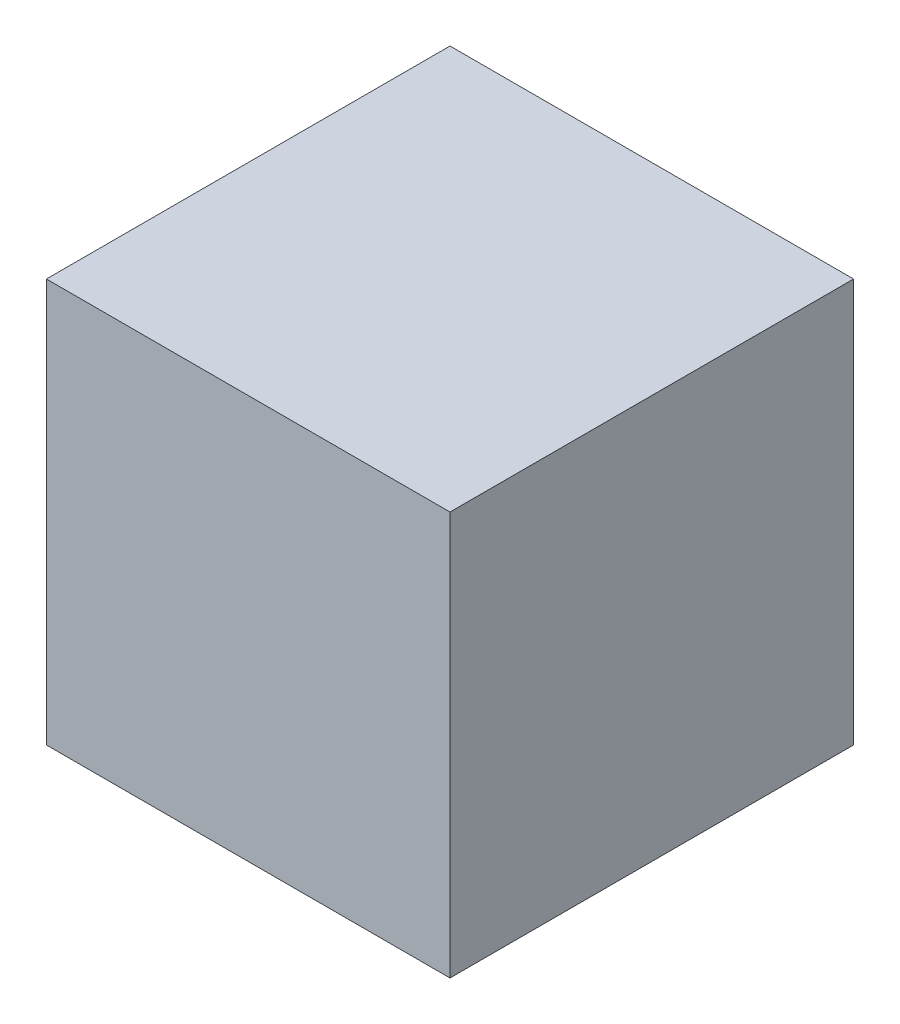
ISO-10303-21;
HEADER;
FILE_DESCRIPTION(('STEP AP214'),'2;1');
FILE_NAME('part.step','',(''),(''),'','','');
FILE_SCHEMA(('AUTOMOTIVE_DESIGN { 1 0 10303 214 1 1 1 1 }'));
ENDSEC;
DATA;
#1=APPLICATION_CONTEXT('core data for automotive mechanical design processes');
#2=APPLICATION_PROTOCOL_DEFINITION('international standard','automotive_design',2000,#1);
#3=PRODUCT_CONTEXT('',#1,'mechanical');
#4=PRODUCT('Part','Part','',(#3));
#5=PRODUCT_RELATED_PRODUCT_CATEGORY('part','',(#4));
#6=PRODUCT_DEFINITION_FORMATION('','',#4);
#7=PRODUCT_DEFINITION_CONTEXT('part definition',#1,'design');
#8=PRODUCT_DEFINITION('design','',#6,#7);
#9=PRODUCT_DEFINITION_SHAPE('','',#8);
#10=(LENGTH_UNIT() NAMED_UNIT(*) SI_UNIT(.MILLI.,.METRE.));
#11=(NAMED_UNIT(*) PLANE_ANGLE_UNIT() SI_UNIT($,.RADIAN.));
#12=(NAMED_UNIT(*) SI_UNIT($,.STERADIAN.) SOLID_ANGLE_UNIT());
#13=UNCERTAINTY_MEASURE_WITH_UNIT(LENGTH_MEASURE(1.E-05),#10,'distance_accuracy_value','');
#14=(GEOMETRIC_REPRESENTATION_CONTEXT(3) GLOBAL_UNCERTAINTY_ASSIGNED_CONTEXT((#13)) GLOBAL_UNIT_ASSIGNED_CONTEXT((#10,
#11,#12)) REPRESENTATION_CONTEXT('',''));
#15=CARTESIAN_POINT('',(0.,0.,0.));
#16=DIRECTION('',(0.,0.,1.));
#17=DIRECTION('',(1.,0.,0.));
#18=AXIS2_PLACEMENT_3D('',#15,#16,#17);
#19=CARTESIAN_POINT('',(0.127,0.127,0.));
#20=DIRECTION('',(0.,-1.,0.));
#21=DIRECTION('',(0.,0.,-1.));
#22=AXIS2_PLACEMENT_3D('',#19,#20,#21);
#23=PLANE('',#22);
#24=DIRECTION('',(0.,0.,-1.));
#25=VECTOR('',#24,1.);
#26=CARTESIAN_POINT('',(-0.127,0.127,0.));
#27=LINE('',#26,#25);
#28=CARTESIAN_POINT('',(-0.127,0.127,0.));
#29=VERTEX_POINT('',#28);
#30=CARTESIAN_POINT('',(-0.127,0.127,0.254));
#31=VERTEX_POINT('',#30);
#32=EDGE_CURVE('E19',#29,#31,#27,.F.);
#33=ORIENTED_EDGE('',*,*,#32,.T.);
#34=DIRECTION('',(-1.,0.,0.));
#35=VECTOR('',#34,1.);
#36=CARTESIAN_POINT('',(-0.127,0.127,0.254));
#37=LINE('',#36,#35);
#38=CARTESIAN_POINT('',(0.127,0.127,0.254));
#39=VERTEX_POINT('',#38);
#40=EDGE_CURVE('E54',#31,#39,#37,.F.);
#41=ORIENTED_EDGE('',*,*,#40,.T.);
#42=DIRECTION('',(0.,0.,1.));
#43=VECTOR('',#42,1.);
#44=CARTESIAN_POINT('',(0.127,0.127,0.));
#45=LINE('',#44,#43);
#46=CARTESIAN_POINT('',(0.127,0.127,0.));
#47=VERTEX_POINT('',#46);
#48=EDGE_CURVE('E75',#39,#47,#45,.F.);
#49=ORIENTED_EDGE('',*,*,#48,.T.);
#50=DIRECTION('',(-1.,0.,0.));
#51=VECTOR('',#50,1.);
#52=CARTESIAN_POINT('',(-0.127,0.127,0.));
#53=LINE('',#52,#51);
#54=EDGE_CURVE('E57',#29,#47,#53,.F.);
#55=ORIENTED_EDGE('',*,*,#54,.F.);
#56=EDGE_LOOP('',(#33,#41,#49,#55));
#57=FACE_BOUND('',#56,.T.);
#58=ADVANCED_FACE('F16',(#57),#23,.F.);
#59=CARTESIAN_POINT('',(-0.127,0.127,0.));
#60=DIRECTION('',(1.,0.,0.));
#61=DIRECTION('',(0.,0.,-1.));
#62=AXIS2_PLACEMENT_3D('',#59,#60,#61);
#63=PLANE('',#62);
#64=DIRECTION('',(0.,0.,1.));
#65=VECTOR('',#64,1.);
#66=CARTESIAN_POINT('',(-0.127,-0.127,0.));
#67=LINE('',#66,#65);
#68=CARTESIAN_POINT('',(-0.127,-0.127,0.));
#69=VERTEX_POINT('',#68);
#70=CARTESIAN_POINT('',(-0.127,-0.127,0.254));
#71=VERTEX_POINT('',#70);
#72=EDGE_CURVE('E72',#69,#71,#67,.T.);
#73=ORIENTED_EDGE('',*,*,#72,.T.);
#74=DIRECTION('',(0.,1.,0.));
#75=VECTOR('',#74,1.);
#76=CARTESIAN_POINT('',(-0.127,-0.127,0.254));
#77=LINE('',#76,#75);
#78=EDGE_CURVE('E62',#71,#31,#77,.T.);
#79=ORIENTED_EDGE('',*,*,#78,.T.);
#80=ORIENTED_EDGE('',*,*,#32,.F.);
#81=DIRECTION('',(0.,1.,0.));
#82=VECTOR('',#81,1.);
#83=CARTESIAN_POINT('',(-0.127,-0.127,0.));
#84=LINE('',#83,#82);
#85=EDGE_CURVE('E77',#69,#29,#84,.T.);
#86=ORIENTED_EDGE('',*,*,#85,.F.);
#87=EDGE_LOOP('',(#73,#79,#80,#86));
#88=FACE_BOUND('',#87,.T.);
#89=ADVANCED_FACE('F71',(#88),#63,.F.);
#90=CARTESIAN_POINT('',(-0.127,-0.127,0.254));
#91=DIRECTION('',(0.,0.,-1.));
#92=DIRECTION('',(-1.,0.,0.));
#93=AXIS2_PLACEMENT_3D('',#90,#91,#92);
#94=PLANE('',#93);
#95=DIRECTION('',(0.,1.,0.));
#96=VECTOR('',#95,1.);
#97=CARTESIAN_POINT('',(0.127,-0.127,0.254));
#98=LINE('',#97,#96);
#99=CARTESIAN_POINT('',(0.127,-0.127,0.254));
#100=VERTEX_POINT('',#99);
#101=EDGE_CURVE('E68',#100,#39,#98,.T.);
#102=ORIENTED_EDGE('',*,*,#101,.T.);
#103=ORIENTED_EDGE('',*,*,#40,.F.);
#104=ORIENTED_EDGE('',*,*,#78,.F.);
#105=DIRECTION('',(1.,0.,0.));
#106=VECTOR('',#105,1.);
#107=CARTESIAN_POINT('',(-0.127,-0.127,0.254));
#108=LINE('',#107,#106);
#109=EDGE_CURVE('E82',#71,#100,#108,.T.);
#110=ORIENTED_EDGE('',*,*,#109,.T.);
#111=EDGE_LOOP('',(#102,#103,#104,#110));
#112=FACE_BOUND('',#111,.T.);
#113=ADVANCED_FACE('F65',(#112),#94,.F.);
#114=CARTESIAN_POINT('',(0.127,-0.127,0.));
#115=DIRECTION('',(-1.,0.,0.));
#116=DIRECTION('',(0.,0.,1.));
#117=AXIS2_PLACEMENT_3D('',#114,#115,#116);
#118=PLANE('',#117);
#119=ORIENTED_EDGE('',*,*,#48,.F.);
#120=ORIENTED_EDGE('',*,*,#101,.F.);
#121=DIRECTION('',(0.,0.,1.));
#122=VECTOR('',#121,1.);
#123=CARTESIAN_POINT('',(0.127,-0.127,0.));
#124=LINE('',#123,#122);
#125=CARTESIAN_POINT('',(0.127,-0.127,0.));
#126=VERTEX_POINT('',#125);
#127=EDGE_CURVE('E25',#100,#126,#124,.F.);
#128=ORIENTED_EDGE('',*,*,#127,.T.);
#129=DIRECTION('',(0.,1.,0.));
#130=VECTOR('',#129,1.);
#131=CARTESIAN_POINT('',(0.127,-0.127,0.));
#132=LINE('',#131,#130);
#133=EDGE_CURVE('E33',#47,#126,#132,.F.);
#134=ORIENTED_EDGE('',*,*,#133,.F.);
#135=EDGE_LOOP('',(#119,#120,#128,#134));
#136=FACE_BOUND('',#135,.T.);
#137=ADVANCED_FACE('F87',(#136),#118,.F.);
#138=CARTESIAN_POINT('',(-0.127,-0.127,0.));
#139=DIRECTION('',(0.,0.,-1.));
#140=DIRECTION('',(-1.,0.,0.));
#141=AXIS2_PLACEMENT_3D('',#138,#139,#140);
#142=PLANE('',#141);
#143=ORIENTED_EDGE('',*,*,#133,.T.);
#144=DIRECTION('',(1.,0.,0.));
#145=VECTOR('',#144,1.);
#146=CARTESIAN_POINT('',(-0.127,-0.127,0.));
#147=LINE('',#146,#145);
#148=EDGE_CURVE('E11',#126,#69,#147,.F.);
#149=ORIENTED_EDGE('',*,*,#148,.T.);
#150=ORIENTED_EDGE('',*,*,#85,.T.);
#151=ORIENTED_EDGE('',*,*,#54,.T.);
#152=EDGE_LOOP('',(#143,#149,#150,#151));
#153=FACE_BOUND('',#152,.T.);
#154=ADVANCED_FACE('F90',(#153),#142,.T.);
#155=CARTESIAN_POINT('',(-0.127,-0.127,0.));
#156=DIRECTION('',(0.,1.,0.));
#157=DIRECTION('',(0.,0.,1.));
#158=AXIS2_PLACEMENT_3D('',#155,#156,#157);
#159=PLANE('',#158);
#160=ORIENTED_EDGE('',*,*,#127,.F.);
#161=ORIENTED_EDGE('',*,*,#109,.F.);
#162=ORIENTED_EDGE('',*,*,#72,.F.);
#163=ORIENTED_EDGE('',*,*,#148,.F.);
#164=EDGE_LOOP('',(#160,#161,#162,#163));
#165=FACE_BOUND('',#164,.T.);
#166=ADVANCED_FACE('F89',(#165),#159,.F.);
#167=CLOSED_SHELL('',(#58,#89,#113,#137,#154,#166));
#168=MANIFOLD_SOLID_BREP('B1',#167);
#169=ADVANCED_BREP_SHAPE_REPRESENTATION('',(#18,#168),#14);
#170=SHAPE_DEFINITION_REPRESENTATION(#9,#169);
ENDSEC;
END-ISO-10303-21;
